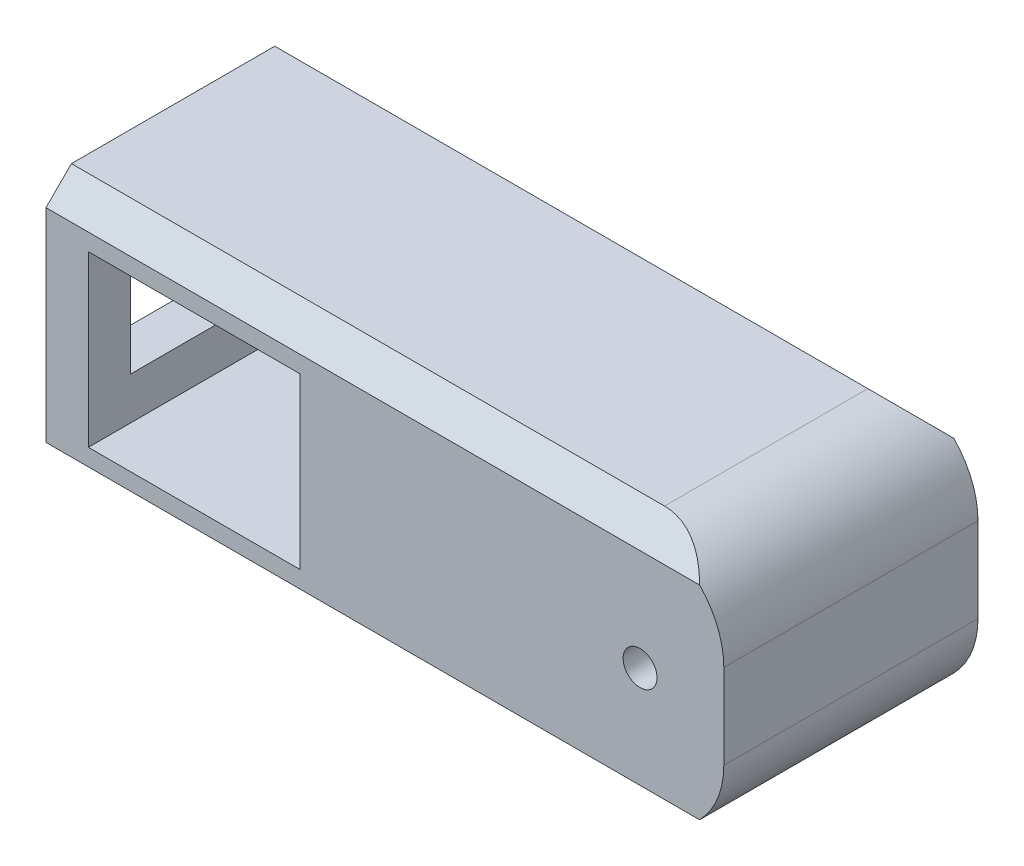
ISO-10303-21;
HEADER;
FILE_DESCRIPTION(('STEP AP214'),'2;1');
FILE_NAME('part.step','',(''),(''),'','','');
FILE_SCHEMA(('AUTOMOTIVE_DESIGN { 1 0 10303 214 1 1 1 1 }'));
ENDSEC;
DATA;
#1=APPLICATION_CONTEXT('core data for automotive mechanical design processes');
#2=APPLICATION_PROTOCOL_DEFINITION('international standard','automotive_design',2000,#1);
#3=PRODUCT_CONTEXT('',#1,'mechanical');
#4=PRODUCT('Part','Part','',(#3));
#5=PRODUCT_RELATED_PRODUCT_CATEGORY('part','',(#4));
#6=PRODUCT_DEFINITION_FORMATION('','',#4);
#7=PRODUCT_DEFINITION_CONTEXT('part definition',#1,'design');
#8=PRODUCT_DEFINITION('design','',#6,#7);
#9=PRODUCT_DEFINITION_SHAPE('','',#8);
#10=(LENGTH_UNIT() NAMED_UNIT(*) SI_UNIT(.MILLI.,.METRE.));
#11=(NAMED_UNIT(*) PLANE_ANGLE_UNIT() SI_UNIT($,.RADIAN.));
#12=(NAMED_UNIT(*) SI_UNIT($,.STERADIAN.) SOLID_ANGLE_UNIT());
#13=UNCERTAINTY_MEASURE_WITH_UNIT(LENGTH_MEASURE(1.E-05),#10,'distance_accuracy_value','');
#14=(GEOMETRIC_REPRESENTATION_CONTEXT(3) GLOBAL_UNCERTAINTY_ASSIGNED_CONTEXT((#13)) GLOBAL_UNIT_ASSIGNED_CONTEXT((#10,
#11,#12)) REPRESENTATION_CONTEXT('',''));
#15=CARTESIAN_POINT('',(0.,0.,0.));
#16=DIRECTION('',(0.,0.,1.));
#17=DIRECTION('',(1.,0.,0.));
#18=AXIS2_PLACEMENT_3D('',#15,#16,#17);
#19=CARTESIAN_POINT('',(40.,30.,-15.));
#20=DIRECTION('',(-1.,0.,0.));
#21=DIRECTION('',(0.,0.,1.));
#22=AXIS2_PLACEMENT_3D('',#19,#20,#21);
#23=PLANE('',#22);
#24=DIRECTION('',(0.,-1.,0.));
#25=VECTOR('',#24,1.);
#26=CARTESIAN_POINT('',(40.,30.,15.));
#27=LINE('',#26,#25);
#28=CARTESIAN_POINT('',(40.,20.,15.));
#29=VERTEX_POINT('',#28);
#30=CARTESIAN_POINT('',(40.,10.,15.));
#31=VERTEX_POINT('',#30);
#32=EDGE_CURVE('E242',#29,#31,#27,.T.);
#33=ORIENTED_EDGE('',*,*,#32,.T.);
#34=DIRECTION('',(0.,0.,-1.));
#35=VECTOR('',#34,1.);
#36=CARTESIAN_POINT('',(40.,10.,-15.));
#37=LINE('',#36,#35);
#38=CARTESIAN_POINT('',(40.,10.,-15.));
#39=VERTEX_POINT('',#38);
#40=EDGE_CURVE('E293',#31,#39,#37,.T.);
#41=ORIENTED_EDGE('',*,*,#40,.T.);
#42=DIRECTION('',(0.,-1.,0.));
#43=VECTOR('',#42,1.);
#44=CARTESIAN_POINT('',(40.,30.,-15.));
#45=LINE('',#44,#43);
#46=CARTESIAN_POINT('',(40.,20.,-15.));
#47=VERTEX_POINT('',#46);
#48=EDGE_CURVE('E255',#47,#39,#45,.T.);
#49=ORIENTED_EDGE('',*,*,#48,.F.);
#50=DIRECTION('',(0.,0.,-1.));
#51=VECTOR('',#50,1.);
#52=CARTESIAN_POINT('',(40.,20.,12.));
#53=LINE('',#52,#51);
#54=EDGE_CURVE('E291',#47,#29,#53,.F.);
#55=ORIENTED_EDGE('',*,*,#54,.T.);
#56=EDGE_LOOP('',(#33,#41,#49,#55));
#57=FACE_BOUND('',#56,.T.);
#58=ADVANCED_FACE('F41',(#57),#23,.F.);
#59=CARTESIAN_POINT('',(-40.,30.,-15.));
#60=DIRECTION('',(0.,0.,1.));
#61=DIRECTION('',(1.,0.,0.));
#62=AXIS2_PLACEMENT_3D('',#59,#60,#61);
#63=PLANE('',#62);
#64=DIRECTION('',(1.,0.,0.));
#65=VECTOR('',#64,1.);
#66=CARTESIAN_POINT('',(-35.,25.,-15.));
#67=LINE('',#66,#65);
#68=CARTESIAN_POINT('',(-35.,25.,-15.));
#69=VERTEX_POINT('',#68);
#70=CARTESIAN_POINT('',(-10.,25.,-15.));
#71=VERTEX_POINT('',#70);
#72=EDGE_CURVE('E220',#69,#71,#67,.T.);
#73=ORIENTED_EDGE('',*,*,#72,.F.);
#74=DIRECTION('',(0.,1.,0.));
#75=VECTOR('',#74,1.);
#76=CARTESIAN_POINT('',(-35.,5.,-15.));
#77=LINE('',#76,#75);
#78=CARTESIAN_POINT('',(-35.,5.,-15.));
#79=VERTEX_POINT('',#78);
#80=EDGE_CURVE('E200',#79,#69,#77,.T.);
#81=ORIENTED_EDGE('',*,*,#80,.F.);
#82=DIRECTION('',(-1.,0.,0.));
#83=VECTOR('',#82,1.);
#84=CARTESIAN_POINT('',(-35.,5.,-15.));
#85=LINE('',#84,#83);
#86=CARTESIAN_POINT('',(-10.,5.,-15.));
#87=VERTEX_POINT('',#86);
#88=EDGE_CURVE('E206',#87,#79,#85,.T.);
#89=ORIENTED_EDGE('',*,*,#88,.F.);
#90=DIRECTION('',(0.,-1.,0.));
#91=VECTOR('',#90,1.);
#92=CARTESIAN_POINT('',(-10.,5.,-15.));
#93=LINE('',#92,#91);
#94=EDGE_CURVE('E219',#71,#87,#93,.T.);
#95=ORIENTED_EDGE('',*,*,#94,.F.);
#96=EDGE_LOOP('',(#73,#81,#89,#95));
#97=FACE_BOUND('',#96,.T.);
#98=CARTESIAN_POINT('',(30.1148646301123,15.,-15.));
#99=DIRECTION('',(0.,0.,1.));
#100=DIRECTION('',(1.,0.,0.));
#101=AXIS2_PLACEMENT_3D('',#98,#99,#100);
#102=CIRCLE('',#101,2.);
#103=CARTESIAN_POINT('',(32.1148646301123,15.,-15.));
#104=VERTEX_POINT('',#103);
#105=EDGE_CURVE('E235',#104,#104,#102,.T.);
#106=ORIENTED_EDGE('',*,*,#105,.T.);
#107=EDGE_LOOP('',(#106));
#108=FACE_BOUND('',#107,.T.);
#109=ORIENTED_EDGE('',*,*,#48,.T.);
#110=CARTESIAN_POINT('',(30.,10.,-15.));
#111=DIRECTION('',(0.,0.,1.));
#112=DIRECTION('',(1.,0.,0.));
#113=AXIS2_PLACEMENT_3D('',#110,#111,#112);
#114=CIRCLE('',#113,10.);
#115=CARTESIAN_POINT('',(37.1414284285428,3.,-15.));
#116=VERTEX_POINT('',#115);
#117=EDGE_CURVE('E299',#39,#116,#114,.F.);
#118=ORIENTED_EDGE('',*,*,#117,.T.);
#119=DIRECTION('',(-1.,0.,0.));
#120=VECTOR('',#119,1.);
#121=CARTESIAN_POINT('',(-40.,3.,-15.));
#122=LINE('',#121,#120);
#123=CARTESIAN_POINT('',(-40.,3.,-15.));
#124=VERTEX_POINT('',#123);
#125=EDGE_CURVE('E279',#116,#124,#122,.T.);
#126=ORIENTED_EDGE('',*,*,#125,.T.);
#127=DIRECTION('',(0.,-1.,0.));
#128=VECTOR('',#127,1.);
#129=CARTESIAN_POINT('',(-40.,30.,-15.));
#130=LINE('',#129,#128);
#131=CARTESIAN_POINT('',(-40.,27.,-15.));
#132=VERTEX_POINT('',#131);
#133=EDGE_CURVE('E253',#132,#124,#130,.T.);
#134=ORIENTED_EDGE('',*,*,#133,.F.);
#135=DIRECTION('',(1.,0.,0.));
#136=VECTOR('',#135,1.);
#137=CARTESIAN_POINT('',(40.,27.,-15.));
#138=LINE('',#137,#136);
#139=CARTESIAN_POINT('',(37.1414284285429,27.,-15.));
#140=VERTEX_POINT('',#139);
#141=EDGE_CURVE('E274',#132,#140,#138,.T.);
#142=ORIENTED_EDGE('',*,*,#141,.T.);
#143=CARTESIAN_POINT('',(30.,20.,-15.));
#144=DIRECTION('',(0.,0.,1.));
#145=DIRECTION('',(1.,0.,0.));
#146=AXIS2_PLACEMENT_3D('',#143,#144,#145);
#147=CIRCLE('',#146,10.);
#148=EDGE_CURVE('E297',#140,#47,#147,.F.);
#149=ORIENTED_EDGE('',*,*,#148,.T.);
#150=EDGE_LOOP('',(#109,#118,#126,#134,#142,#149));
#151=FACE_BOUND('',#150,.T.);
#152=ADVANCED_FACE('F319',(#97,#108,#151),#63,.F.);
#153=CARTESIAN_POINT('',(-40.,30.,-15.));
#154=DIRECTION('',(1.,0.,0.));
#155=DIRECTION('',(0.,0.,-1.));
#156=AXIS2_PLACEMENT_3D('',#153,#154,#155);
#157=PLANE('',#156);
#158=DIRECTION('',(0.,0.,-1.));
#159=VECTOR('',#158,1.);
#160=CARTESIAN_POINT('',(-40.,20.,-10.));
#161=LINE('',#160,#159);
#162=CARTESIAN_POINT('',(-40.,20.,10.));
#163=VERTEX_POINT('',#162);
#164=CARTESIAN_POINT('',(-40.,20.,-10.));
#165=VERTEX_POINT('',#164);
#166=EDGE_CURVE('E185',#163,#165,#161,.T.);
#167=ORIENTED_EDGE('',*,*,#166,.F.);
#168=DIRECTION('',(0.,1.,0.));
#169=VECTOR('',#168,1.);
#170=CARTESIAN_POINT('',(-40.,20.,10.));
#171=LINE('',#170,#169);
#172=CARTESIAN_POINT('',(-40.,10.,10.));
#173=VERTEX_POINT('',#172);
#174=EDGE_CURVE('E190',#173,#163,#171,.T.);
#175=ORIENTED_EDGE('',*,*,#174,.F.);
#176=DIRECTION('',(0.,0.,1.));
#177=VECTOR('',#176,1.);
#178=CARTESIAN_POINT('',(-40.,10.,-10.));
#179=LINE('',#178,#177);
#180=CARTESIAN_POINT('',(-40.,10.,-10.));
#181=VERTEX_POINT('',#180);
#182=EDGE_CURVE('E194',#181,#173,#179,.T.);
#183=ORIENTED_EDGE('',*,*,#182,.F.);
#184=DIRECTION('',(0.,-1.,0.));
#185=VECTOR('',#184,1.);
#186=CARTESIAN_POINT('',(-40.,20.,-10.));
#187=LINE('',#186,#185);
#188=EDGE_CURVE('E171',#165,#181,#187,.T.);
#189=ORIENTED_EDGE('',*,*,#188,.F.);
#190=EDGE_LOOP('',(#167,#175,#183,#189));
#191=FACE_BOUND('',#190,.T.);
#192=DIRECTION('',(0.,0.,1.));
#193=VECTOR('',#192,1.);
#194=CARTESIAN_POINT('',(-40.,0.,-15.));
#195=LINE('',#194,#193);
#196=CARTESIAN_POINT('',(-40.,0.,-12.));
#197=VERTEX_POINT('',#196);
#198=CARTESIAN_POINT('',(-40.,0.,12.));
#199=VERTEX_POINT('',#198);
#200=EDGE_CURVE('E240',#197,#199,#195,.T.);
#201=ORIENTED_EDGE('',*,*,#200,.T.);
#202=DIRECTION('',(0.,-0.707106781186546,-0.707106781186549));
#203=VECTOR('',#202,1.);
#204=CARTESIAN_POINT('',(-40.,3.,15.));
#205=LINE('',#204,#203);
#206=CARTESIAN_POINT('',(-40.,3.,15.));
#207=VERTEX_POINT('',#206);
#208=EDGE_CURVE('E272',#199,#207,#205,.F.);
#209=ORIENTED_EDGE('',*,*,#208,.T.);
#210=DIRECTION('',(0.,-1.,0.));
#211=VECTOR('',#210,1.);
#212=CARTESIAN_POINT('',(-40.,30.,15.));
#213=LINE('',#212,#211);
#214=CARTESIAN_POINT('',(-40.,27.,15.));
#215=VERTEX_POINT('',#214);
#216=EDGE_CURVE('E247',#215,#207,#213,.T.);
#217=ORIENTED_EDGE('',*,*,#216,.F.);
#218=DIRECTION('',(0.,0.707106781186549,-0.707106781186546));
#219=VECTOR('',#218,1.);
#220=CARTESIAN_POINT('',(-40.,30.,12.));
#221=LINE('',#220,#219);
#222=CARTESIAN_POINT('',(-40.,30.,12.));
#223=VERTEX_POINT('',#222);
#224=EDGE_CURVE('E270',#215,#223,#221,.T.);
#225=ORIENTED_EDGE('',*,*,#224,.T.);
#226=DIRECTION('',(0.,0.,1.));
#227=VECTOR('',#226,1.);
#228=CARTESIAN_POINT('',(-40.,30.,-15.));
#229=LINE('',#228,#227);
#230=CARTESIAN_POINT('',(-40.,30.,-12.));
#231=VERTEX_POINT('',#230);
#232=EDGE_CURVE('E238',#231,#223,#229,.T.);
#233=ORIENTED_EDGE('',*,*,#232,.F.);
#234=DIRECTION('',(0.,-0.707106781186549,-0.707106781186546));
#235=VECTOR('',#234,1.);
#236=CARTESIAN_POINT('',(-40.,30.,-12.));
#237=LINE('',#236,#235);
#238=EDGE_CURVE('E267',#231,#132,#237,.T.);
#239=ORIENTED_EDGE('',*,*,#238,.T.);
#240=ORIENTED_EDGE('',*,*,#133,.T.);
#241=DIRECTION('',(0.,0.707106781186546,-0.707106781186549));
#242=VECTOR('',#241,1.);
#243=CARTESIAN_POINT('',(-40.,3.,-15.));
#244=LINE('',#243,#242);
#245=EDGE_CURVE('E271',#124,#197,#244,.F.);
#246=ORIENTED_EDGE('',*,*,#245,.T.);
#247=EDGE_LOOP('',(#201,#209,#217,#225,#233,#239,#240,#246));
#248=FACE_BOUND('',#247,.T.);
#249=ADVANCED_FACE('F188',(#191,#248),#157,.F.);
#250=CARTESIAN_POINT('',(-40.,30.,15.));
#251=DIRECTION('',(0.,0.,-1.));
#252=DIRECTION('',(-1.,0.,0.));
#253=AXIS2_PLACEMENT_3D('',#250,#251,#252);
#254=PLANE('',#253);
#255=DIRECTION('',(-1.,0.,0.));
#256=VECTOR('',#255,1.);
#257=CARTESIAN_POINT('',(-35.,5.,15.));
#258=LINE('',#257,#256);
#259=CARTESIAN_POINT('',(-10.,5.,15.));
#260=VERTEX_POINT('',#259);
#261=CARTESIAN_POINT('',(-35.,5.,15.));
#262=VERTEX_POINT('',#261);
#263=EDGE_CURVE('E215',#260,#262,#258,.T.);
#264=ORIENTED_EDGE('',*,*,#263,.T.);
#265=DIRECTION('',(0.,1.,0.));
#266=VECTOR('',#265,1.);
#267=CARTESIAN_POINT('',(-35.,5.,15.));
#268=LINE('',#267,#266);
#269=CARTESIAN_POINT('',(-35.,25.,15.));
#270=VERTEX_POINT('',#269);
#271=EDGE_CURVE('E205',#262,#270,#268,.T.);
#272=ORIENTED_EDGE('',*,*,#271,.T.);
#273=DIRECTION('',(1.,0.,0.));
#274=VECTOR('',#273,1.);
#275=CARTESIAN_POINT('',(-35.,25.,15.));
#276=LINE('',#275,#274);
#277=CARTESIAN_POINT('',(-10.,25.,15.));
#278=VERTEX_POINT('',#277);
#279=EDGE_CURVE('E202',#270,#278,#276,.T.);
#280=ORIENTED_EDGE('',*,*,#279,.T.);
#281=DIRECTION('',(0.,-1.,0.));
#282=VECTOR('',#281,1.);
#283=CARTESIAN_POINT('',(-10.,5.,15.));
#284=LINE('',#283,#282);
#285=EDGE_CURVE('E207',#278,#260,#284,.T.);
#286=ORIENTED_EDGE('',*,*,#285,.T.);
#287=EDGE_LOOP('',(#264,#272,#280,#286));
#288=FACE_BOUND('',#287,.T.);
#289=CARTESIAN_POINT('',(30.1148646301123,15.,15.));
#290=DIRECTION('',(0.,0.,1.));
#291=DIRECTION('',(1.,0.,0.));
#292=AXIS2_PLACEMENT_3D('',#289,#290,#291);
#293=CIRCLE('',#292,2.);
#294=CARTESIAN_POINT('',(32.1148646301123,15.,15.));
#295=VERTEX_POINT('',#294);
#296=EDGE_CURVE('E230',#295,#295,#293,.T.);
#297=ORIENTED_EDGE('',*,*,#296,.F.);
#298=EDGE_LOOP('',(#297));
#299=FACE_BOUND('',#298,.T.);
#300=DIRECTION('',(1.,0.,0.));
#301=VECTOR('',#300,1.);
#302=CARTESIAN_POINT('',(-40.,3.,15.));
#303=LINE('',#302,#301);
#304=CARTESIAN_POINT('',(37.1414284285428,3.,15.));
#305=VERTEX_POINT('',#304);
#306=EDGE_CURVE('E259',#207,#305,#303,.T.);
#307=ORIENTED_EDGE('',*,*,#306,.T.);
#308=CARTESIAN_POINT('',(30.,10.,15.));
#309=DIRECTION('',(0.,0.,-1.));
#310=DIRECTION('',(-1.,0.,0.));
#311=AXIS2_PLACEMENT_3D('',#308,#309,#310);
#312=CIRCLE('',#311,10.);
#313=EDGE_CURVE('E309',#305,#31,#312,.F.);
#314=ORIENTED_EDGE('',*,*,#313,.T.);
#315=ORIENTED_EDGE('',*,*,#32,.F.);
#316=CARTESIAN_POINT('',(30.,20.,15.));
#317=DIRECTION('',(0.,0.,-1.));
#318=DIRECTION('',(-1.,0.,0.));
#319=AXIS2_PLACEMENT_3D('',#316,#317,#318);
#320=CIRCLE('',#319,10.);
#321=CARTESIAN_POINT('',(37.1414284285428,27.,15.));
#322=VERTEX_POINT('',#321);
#323=EDGE_CURVE('E306',#29,#322,#320,.F.);
#324=ORIENTED_EDGE('',*,*,#323,.T.);
#325=DIRECTION('',(-1.,0.,0.));
#326=VECTOR('',#325,1.);
#327=CARTESIAN_POINT('',(-40.,27.,15.));
#328=LINE('',#327,#326);
#329=EDGE_CURVE('E260',#322,#215,#328,.T.);
#330=ORIENTED_EDGE('',*,*,#329,.T.);
#331=ORIENTED_EDGE('',*,*,#216,.T.);
#332=EDGE_LOOP('',(#307,#314,#315,#324,#330,#331));
#333=FACE_BOUND('',#332,.T.);
#334=ADVANCED_FACE('F327',(#288,#299,#333),#254,.F.);
#335=CARTESIAN_POINT('',(0.,30.,0.));
#336=DIRECTION('',(0.,1.,0.));
#337=DIRECTION('',(0.,0.,1.));
#338=AXIS2_PLACEMENT_3D('',#335,#336,#337);
#339=PLANE('',#338);
#340=DIRECTION('',(1.,0.,0.));
#341=VECTOR('',#340,1.);
#342=CARTESIAN_POINT('',(40.,30.,12.));
#343=LINE('',#342,#341);
#344=CARTESIAN_POINT('',(30.,30.,12.));
#345=VERTEX_POINT('',#344);
#346=EDGE_CURVE('E278',#223,#345,#343,.T.);
#347=ORIENTED_EDGE('',*,*,#346,.T.);
#348=DIRECTION('',(0.,0.,-1.));
#349=VECTOR('',#348,1.);
#350=CARTESIAN_POINT('',(30.,30.,-12.));
#351=LINE('',#350,#349);
#352=CARTESIAN_POINT('',(30.,30.,-12.));
#353=VERTEX_POINT('',#352);
#354=EDGE_CURVE('E315',#345,#353,#351,.T.);
#355=ORIENTED_EDGE('',*,*,#354,.T.);
#356=DIRECTION('',(-1.,0.,0.));
#357=VECTOR('',#356,1.);
#358=CARTESIAN_POINT('',(-40.,30.,-12.));
#359=LINE('',#358,#357);
#360=EDGE_CURVE('E285',#353,#231,#359,.T.);
#361=ORIENTED_EDGE('',*,*,#360,.T.);
#362=ORIENTED_EDGE('',*,*,#232,.T.);
#363=EDGE_LOOP('',(#347,#355,#361,#362));
#364=FACE_BOUND('',#363,.T.);
#365=ADVANCED_FACE('F355',(#364),#339,.T.);
#366=CARTESIAN_POINT('',(0.,0.,0.));
#367=DIRECTION('',(0.,1.,0.));
#368=DIRECTION('',(0.,0.,1.));
#369=AXIS2_PLACEMENT_3D('',#366,#367,#368);
#370=PLANE('',#369);
#371=DIRECTION('',(1.,0.,0.));
#372=VECTOR('',#371,1.);
#373=CARTESIAN_POINT('',(0.,0.,-12.));
#374=LINE('',#373,#372);
#375=CARTESIAN_POINT('',(30.,0.,-12.));
#376=VERTEX_POINT('',#375);
#377=EDGE_CURVE('E265',#197,#376,#374,.T.);
#378=ORIENTED_EDGE('',*,*,#377,.T.);
#379=DIRECTION('',(0.,0.,-1.));
#380=VECTOR('',#379,1.);
#381=CARTESIAN_POINT('',(30.,0.,0.));
#382=LINE('',#381,#380);
#383=CARTESIAN_POINT('',(30.,0.,12.));
#384=VERTEX_POINT('',#383);
#385=EDGE_CURVE('E305',#376,#384,#382,.F.);
#386=ORIENTED_EDGE('',*,*,#385,.T.);
#387=DIRECTION('',(-1.,0.,0.));
#388=VECTOR('',#387,1.);
#389=CARTESIAN_POINT('',(0.,0.,12.));
#390=LINE('',#389,#388);
#391=EDGE_CURVE('E264',#384,#199,#390,.T.);
#392=ORIENTED_EDGE('',*,*,#391,.T.);
#393=ORIENTED_EDGE('',*,*,#200,.F.);
#394=EDGE_LOOP('',(#378,#386,#392,#393));
#395=FACE_BOUND('',#394,.T.);
#396=ADVANCED_FACE('F342',(#395),#370,.F.);
#397=CARTESIAN_POINT('',(30.1148646301123,15.,-15.));
#398=DIRECTION('',(0.,0.,1.));
#399=DIRECTION('',(1.,0.,0.));
#400=AXIS2_PLACEMENT_3D('',#397,#398,#399);
#401=CYLINDRICAL_SURFACE('',#400,2.);
#402=ORIENTED_EDGE('',*,*,#105,.F.);
#403=EDGE_LOOP('',(#402));
#404=FACE_BOUND('',#403,.T.);
#405=ORIENTED_EDGE('',*,*,#296,.T.);
#406=EDGE_LOOP('',(#405));
#407=FACE_BOUND('',#406,.T.);
#408=ADVANCED_FACE('F356',(#404,#407),#401,.F.);
#409=CARTESIAN_POINT('',(-40.,3.,15.));
#410=DIRECTION('',(0.,0.707106781186549,-0.707106781186546));
#411=DIRECTION('',(1.,0.,0.));
#412=AXIS2_PLACEMENT_3D('',#409,#410,#411);
#413=PLANE('',#412);
#414=ORIENTED_EDGE('',*,*,#391,.F.);
#415=CARTESIAN_POINT('',(30.,10.,22.));
#416=DIRECTION('',(0.,0.707106781186549,-0.707106781186546));
#417=DIRECTION('',(0.,-0.707106781186546,-0.707106781186549));
#418=AXIS2_PLACEMENT_3D('',#415,#416,#417);
#419=ELLIPSE('',#418,14.142135623731,10.);
#420=EDGE_CURVE('E308',#384,#305,#419,.F.);
#421=ORIENTED_EDGE('',*,*,#420,.T.);
#422=ORIENTED_EDGE('',*,*,#306,.F.);
#423=ORIENTED_EDGE('',*,*,#208,.F.);
#424=EDGE_LOOP('',(#414,#421,#422,#423));
#425=FACE_BOUND('',#424,.T.);
#426=ADVANCED_FACE('F350',(#425),#413,.F.);
#427=CARTESIAN_POINT('',(-40.,3.,-15.));
#428=DIRECTION('',(0.,0.707106781186549,0.707106781186546));
#429=DIRECTION('',(-1.,0.,0.));
#430=AXIS2_PLACEMENT_3D('',#427,#428,#429);
#431=PLANE('',#430);
#432=ORIENTED_EDGE('',*,*,#125,.F.);
#433=CARTESIAN_POINT('',(30.,10.,-22.));
#434=DIRECTION('',(0.,0.707106781186549,0.707106781186546));
#435=DIRECTION('',(0.,0.707106781186546,-0.707106781186549));
#436=AXIS2_PLACEMENT_3D('',#433,#434,#435);
#437=ELLIPSE('',#436,14.142135623731,10.);
#438=EDGE_CURVE('E304',#116,#376,#437,.F.);
#439=ORIENTED_EDGE('',*,*,#438,.T.);
#440=ORIENTED_EDGE('',*,*,#377,.F.);
#441=ORIENTED_EDGE('',*,*,#245,.F.);
#442=EDGE_LOOP('',(#432,#439,#440,#441));
#443=FACE_BOUND('',#442,.T.);
#444=ADVANCED_FACE('F338',(#443),#431,.F.);
#445=CARTESIAN_POINT('',(0.,30.,-12.));
#446=DIRECTION('',(0.,0.707106781186546,-0.707106781186549));
#447=DIRECTION('',(1.,0.,0.));
#448=AXIS2_PLACEMENT_3D('',#445,#446,#447);
#449=PLANE('',#448);
#450=ORIENTED_EDGE('',*,*,#360,.F.);
#451=CARTESIAN_POINT('',(30.,20.,-22.));
#452=DIRECTION('',(0.,0.707106781186546,-0.707106781186549));
#453=DIRECTION('',(0.,0.707106781186549,0.707106781186546));
#454=AXIS2_PLACEMENT_3D('',#451,#452,#453);
#455=ELLIPSE('',#454,14.1421356237309,10.);
#456=EDGE_CURVE('E47',#353,#140,#455,.T.);
#457=ORIENTED_EDGE('',*,*,#456,.T.);
#458=ORIENTED_EDGE('',*,*,#141,.F.);
#459=ORIENTED_EDGE('',*,*,#238,.F.);
#460=EDGE_LOOP('',(#450,#457,#458,#459));
#461=FACE_BOUND('',#460,.T.);
#462=ADVANCED_FACE('F316',(#461),#449,.T.);
#463=CARTESIAN_POINT('',(0.,30.,12.));
#464=DIRECTION('',(0.,0.707106781186546,0.707106781186549));
#465=DIRECTION('',(-1.,0.,0.));
#466=AXIS2_PLACEMENT_3D('',#463,#464,#465);
#467=PLANE('',#466);
#468=ORIENTED_EDGE('',*,*,#329,.F.);
#469=CARTESIAN_POINT('',(30.,20.,22.));
#470=DIRECTION('',(0.,0.707106781186546,0.707106781186549));
#471=DIRECTION('',(0.,-0.707106781186549,0.707106781186546));
#472=AXIS2_PLACEMENT_3D('',#469,#470,#471);
#473=ELLIPSE('',#472,14.1421356237309,10.);
#474=EDGE_CURVE('E11',#322,#345,#473,.T.);
#475=ORIENTED_EDGE('',*,*,#474,.T.);
#476=ORIENTED_EDGE('',*,*,#346,.F.);
#477=ORIENTED_EDGE('',*,*,#224,.F.);
#478=EDGE_LOOP('',(#468,#475,#476,#477));
#479=FACE_BOUND('',#478,.T.);
#480=ADVANCED_FACE('F348',(#479),#467,.T.);
#481=CARTESIAN_POINT('',(-35.,5.,15.));
#482=DIRECTION('',(-1.,0.,0.));
#483=DIRECTION('',(0.,0.,1.));
#484=AXIS2_PLACEMENT_3D('',#481,#482,#483);
#485=PLANE('',#484);
#486=DIRECTION('',(0.,0.,1.));
#487=VECTOR('',#486,1.);
#488=CARTESIAN_POINT('',(-35.,10.,15.));
#489=LINE('',#488,#487);
#490=CARTESIAN_POINT('',(-35.,10.,-10.));
#491=VERTEX_POINT('',#490);
#492=CARTESIAN_POINT('',(-35.,10.,10.));
#493=VERTEX_POINT('',#492);
#494=EDGE_CURVE('E289',#491,#493,#489,.T.);
#495=ORIENTED_EDGE('',*,*,#494,.T.);
#496=DIRECTION('',(0.,1.,0.));
#497=VECTOR('',#496,1.);
#498=CARTESIAN_POINT('',(-35.,5.,10.));
#499=LINE('',#498,#497);
#500=CARTESIAN_POINT('',(-35.,20.,10.));
#501=VERTEX_POINT('',#500);
#502=EDGE_CURVE('E286',#493,#501,#499,.T.);
#503=ORIENTED_EDGE('',*,*,#502,.T.);
#504=DIRECTION('',(0.,0.,-1.));
#505=VECTOR('',#504,1.);
#506=CARTESIAN_POINT('',(-35.,20.,15.));
#507=LINE('',#506,#505);
#508=CARTESIAN_POINT('',(-35.,20.,-10.));
#509=VERTEX_POINT('',#508);
#510=EDGE_CURVE('E283',#501,#509,#507,.T.);
#511=ORIENTED_EDGE('',*,*,#510,.T.);
#512=DIRECTION('',(0.,-1.,0.));
#513=VECTOR('',#512,1.);
#514=CARTESIAN_POINT('',(-35.,4.99999999999999,-10.));
#515=LINE('',#514,#513);
#516=EDGE_CURVE('E173',#509,#491,#515,.T.);
#517=ORIENTED_EDGE('',*,*,#516,.T.);
#518=EDGE_LOOP('',(#495,#503,#511,#517));
#519=FACE_BOUND('',#518,.T.);
#520=ORIENTED_EDGE('',*,*,#80,.T.);
#521=DIRECTION('',(0.,0.,-1.));
#522=VECTOR('',#521,1.);
#523=CARTESIAN_POINT('',(-35.,25.,15.));
#524=LINE('',#523,#522);
#525=EDGE_CURVE('E214',#270,#69,#524,.T.);
#526=ORIENTED_EDGE('',*,*,#525,.F.);
#527=ORIENTED_EDGE('',*,*,#271,.F.);
#528=DIRECTION('',(0.,0.,-1.));
#529=VECTOR('',#528,1.);
#530=CARTESIAN_POINT('',(-35.,5.,15.));
#531=LINE('',#530,#529);
#532=EDGE_CURVE('E223',#262,#79,#531,.T.);
#533=ORIENTED_EDGE('',*,*,#532,.T.);
#534=EDGE_LOOP('',(#520,#526,#527,#533));
#535=FACE_BOUND('',#534,.T.);
#536=ADVANCED_FACE('F393',(#519,#535),#485,.F.);
#537=CARTESIAN_POINT('',(-35.,5.,15.));
#538=DIRECTION('',(0.,-1.,0.));
#539=DIRECTION('',(1.,0.,0.));
#540=AXIS2_PLACEMENT_3D('',#537,#538,#539);
#541=PLANE('',#540);
#542=ORIENTED_EDGE('',*,*,#88,.T.);
#543=ORIENTED_EDGE('',*,*,#532,.F.);
#544=ORIENTED_EDGE('',*,*,#263,.F.);
#545=DIRECTION('',(0.,0.,-1.));
#546=VECTOR('',#545,1.);
#547=CARTESIAN_POINT('',(-10.,5.,15.));
#548=LINE('',#547,#546);
#549=EDGE_CURVE('E227',#260,#87,#548,.T.);
#550=ORIENTED_EDGE('',*,*,#549,.T.);
#551=EDGE_LOOP('',(#542,#543,#544,#550));
#552=FACE_BOUND('',#551,.T.);
#553=ADVANCED_FACE('F414',(#552),#541,.F.);
#554=CARTESIAN_POINT('',(-10.,5.,15.));
#555=DIRECTION('',(1.,0.,0.));
#556=DIRECTION('',(0.,0.,-1.));
#557=AXIS2_PLACEMENT_3D('',#554,#555,#556);
#558=PLANE('',#557);
#559=ORIENTED_EDGE('',*,*,#94,.T.);
#560=ORIENTED_EDGE('',*,*,#549,.F.);
#561=ORIENTED_EDGE('',*,*,#285,.F.);
#562=DIRECTION('',(0.,0.,-1.));
#563=VECTOR('',#562,1.);
#564=CARTESIAN_POINT('',(-10.,25.,15.));
#565=LINE('',#564,#563);
#566=EDGE_CURVE('E229',#278,#71,#565,.T.);
#567=ORIENTED_EDGE('',*,*,#566,.T.);
#568=EDGE_LOOP('',(#559,#560,#561,#567));
#569=FACE_BOUND('',#568,.T.);
#570=ADVANCED_FACE('F411',(#569),#558,.F.);
#571=CARTESIAN_POINT('',(-35.,25.,15.));
#572=DIRECTION('',(0.,1.,0.));
#573=DIRECTION('',(0.,0.,1.));
#574=AXIS2_PLACEMENT_3D('',#571,#572,#573);
#575=PLANE('',#574);
#576=ORIENTED_EDGE('',*,*,#72,.T.);
#577=ORIENTED_EDGE('',*,*,#566,.F.);
#578=ORIENTED_EDGE('',*,*,#279,.F.);
#579=ORIENTED_EDGE('',*,*,#525,.T.);
#580=EDGE_LOOP('',(#576,#577,#578,#579));
#581=FACE_BOUND('',#580,.T.);
#582=ADVANCED_FACE('F409',(#581),#575,.F.);
#583=CARTESIAN_POINT('',(-20.,20.,9.99999999999999));
#584=DIRECTION('',(0.,0.,1.));
#585=DIRECTION('',(1.,0.,0.));
#586=AXIS2_PLACEMENT_3D('',#583,#584,#585);
#587=PLANE('',#586);
#588=DIRECTION('',(-1.,0.,0.));
#589=VECTOR('',#588,1.);
#590=CARTESIAN_POINT('',(-20.,10.,9.99999999999999));
#591=LINE('',#590,#589);
#592=EDGE_CURVE('E197',#493,#173,#591,.T.);
#593=ORIENTED_EDGE('',*,*,#592,.T.);
#594=ORIENTED_EDGE('',*,*,#174,.T.);
#595=DIRECTION('',(-1.,0.,0.));
#596=VECTOR('',#595,1.);
#597=CARTESIAN_POINT('',(-20.,20.,9.99999999999999));
#598=LINE('',#597,#596);
#599=EDGE_CURVE('E177',#501,#163,#598,.T.);
#600=ORIENTED_EDGE('',*,*,#599,.F.);
#601=ORIENTED_EDGE('',*,*,#502,.F.);
#602=EDGE_LOOP('',(#593,#594,#600,#601));
#603=FACE_BOUND('',#602,.T.);
#604=ADVANCED_FACE('F410',(#603),#587,.F.);
#605=CARTESIAN_POINT('',(-20.,10.,-10.));
#606=DIRECTION('',(0.,-1.,0.));
#607=DIRECTION('',(0.,0.,-1.));
#608=AXIS2_PLACEMENT_3D('',#605,#606,#607);
#609=PLANE('',#608);
#610=DIRECTION('',(-1.,0.,0.));
#611=VECTOR('',#610,1.);
#612=CARTESIAN_POINT('',(-20.,10.,-10.));
#613=LINE('',#612,#611);
#614=EDGE_CURVE('E179',#491,#181,#613,.T.);
#615=ORIENTED_EDGE('',*,*,#614,.T.);
#616=ORIENTED_EDGE('',*,*,#182,.T.);
#617=ORIENTED_EDGE('',*,*,#592,.F.);
#618=ORIENTED_EDGE('',*,*,#494,.F.);
#619=EDGE_LOOP('',(#615,#616,#617,#618));
#620=FACE_BOUND('',#619,.T.);
#621=ADVANCED_FACE('F401',(#620),#609,.F.);
#622=CARTESIAN_POINT('',(-20.,20.,-10.));
#623=DIRECTION('',(0.,0.,-1.));
#624=DIRECTION('',(-1.,0.,0.));
#625=AXIS2_PLACEMENT_3D('',#622,#623,#624);
#626=PLANE('',#625);
#627=DIRECTION('',(-1.,0.,0.));
#628=VECTOR('',#627,1.);
#629=CARTESIAN_POINT('',(-20.,20.,-10.));
#630=LINE('',#629,#628);
#631=EDGE_CURVE('E167',#509,#165,#630,.T.);
#632=ORIENTED_EDGE('',*,*,#631,.T.);
#633=ORIENTED_EDGE('',*,*,#188,.T.);
#634=ORIENTED_EDGE('',*,*,#614,.F.);
#635=ORIENTED_EDGE('',*,*,#516,.F.);
#636=EDGE_LOOP('',(#632,#633,#634,#635));
#637=FACE_BOUND('',#636,.T.);
#638=ADVANCED_FACE('F169',(#637),#626,.F.);
#639=CARTESIAN_POINT('',(-20.,20.,-10.));
#640=DIRECTION('',(0.,1.,0.));
#641=DIRECTION('',(0.,0.,1.));
#642=AXIS2_PLACEMENT_3D('',#639,#640,#641);
#643=PLANE('',#642);
#644=ORIENTED_EDGE('',*,*,#599,.T.);
#645=ORIENTED_EDGE('',*,*,#166,.T.);
#646=ORIENTED_EDGE('',*,*,#631,.F.);
#647=ORIENTED_EDGE('',*,*,#510,.F.);
#648=EDGE_LOOP('',(#644,#645,#646,#647));
#649=FACE_BOUND('',#648,.T.);
#650=ADVANCED_FACE('F181',(#649),#643,.F.);
#651=CARTESIAN_POINT('',(30.,10.,-15.));
#652=DIRECTION('',(0.,0.,-1.));
#653=DIRECTION('',(-1.,0.,0.));
#654=AXIS2_PLACEMENT_3D('',#651,#652,#653);
#655=CYLINDRICAL_SURFACE('',#654,10.);
#656=ORIENTED_EDGE('',*,*,#420,.F.);
#657=ORIENTED_EDGE('',*,*,#385,.F.);
#658=ORIENTED_EDGE('',*,*,#438,.F.);
#659=ORIENTED_EDGE('',*,*,#117,.F.);
#660=ORIENTED_EDGE('',*,*,#40,.F.);
#661=ORIENTED_EDGE('',*,*,#313,.F.);
#662=EDGE_LOOP('',(#656,#657,#658,#659,#660,#661));
#663=FACE_BOUND('',#662,.T.);
#664=ADVANCED_FACE('F334',(#663),#655,.T.);
#665=CARTESIAN_POINT('',(30.,20.,0.));
#666=DIRECTION('',(0.,0.,1.));
#667=DIRECTION('',(1.,0.,0.));
#668=AXIS2_PLACEMENT_3D('',#665,#666,#667);
#669=CYLINDRICAL_SURFACE('',#668,10.);
#670=ORIENTED_EDGE('',*,*,#323,.F.);
#671=ORIENTED_EDGE('',*,*,#54,.F.);
#672=ORIENTED_EDGE('',*,*,#148,.F.);
#673=ORIENTED_EDGE('',*,*,#456,.F.);
#674=ORIENTED_EDGE('',*,*,#354,.F.);
#675=ORIENTED_EDGE('',*,*,#474,.F.);
#676=EDGE_LOOP('',(#670,#671,#672,#673,#674,#675));
#677=FACE_BOUND('',#676,.T.);
#678=ADVANCED_FACE('F43',(#677),#669,.T.);
#679=CLOSED_SHELL('',(#58,#152,#249,#334,#365,#396,#408,#426,#444,#462,#480,#536,#553,#570,#582,
#604,#621,#638,#650,#664,#678));
#680=MANIFOLD_SOLID_BREP('B2',#679);
#681=ADVANCED_BREP_SHAPE_REPRESENTATION('',(#18,#680),#14);
#682=SHAPE_DEFINITION_REPRESENTATION(#9,#681);
ENDSEC;
END-ISO-10303-21;
